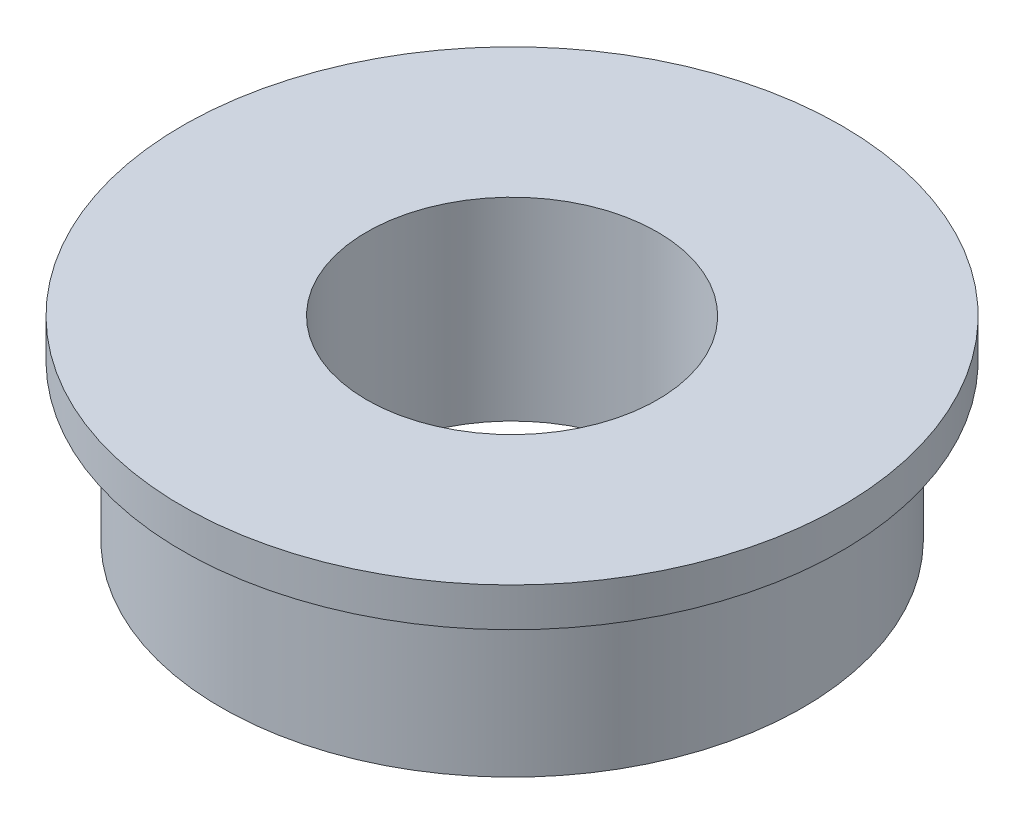
ISO-10303-21;
HEADER;
FILE_DESCRIPTION(('STEP AP214'),'2;1');
FILE_NAME('part.step','',(''),(''),'','','');
FILE_SCHEMA(('AUTOMOTIVE_DESIGN { 1 0 10303 214 1 1 1 1 }'));
ENDSEC;
DATA;
#1=APPLICATION_CONTEXT('core data for automotive mechanical design processes');
#2=APPLICATION_PROTOCOL_DEFINITION('international standard','automotive_design',2000,#1);
#3=PRODUCT_CONTEXT('',#1,'mechanical');
#4=PRODUCT('Part','Part','',(#3));
#5=PRODUCT_RELATED_PRODUCT_CATEGORY('part','',(#4));
#6=PRODUCT_DEFINITION_FORMATION('','',#4);
#7=PRODUCT_DEFINITION_CONTEXT('part definition',#1,'design');
#8=PRODUCT_DEFINITION('design','',#6,#7);
#9=PRODUCT_DEFINITION_SHAPE('','',#8);
#10=(LENGTH_UNIT() NAMED_UNIT(*) SI_UNIT(.MILLI.,.METRE.));
#11=(NAMED_UNIT(*) PLANE_ANGLE_UNIT() SI_UNIT($,.RADIAN.));
#12=(NAMED_UNIT(*) SI_UNIT($,.STERADIAN.) SOLID_ANGLE_UNIT());
#13=UNCERTAINTY_MEASURE_WITH_UNIT(LENGTH_MEASURE(1.E-05),#10,'distance_accuracy_value','');
#14=(GEOMETRIC_REPRESENTATION_CONTEXT(3) GLOBAL_UNCERTAINTY_ASSIGNED_CONTEXT((#13)) GLOBAL_UNIT_ASSIGNED_CONTEXT((#10,
#11,#12)) REPRESENTATION_CONTEXT('',''));
#15=CARTESIAN_POINT('',(0.,0.,0.));
#16=DIRECTION('',(0.,0.,1.));
#17=DIRECTION('',(1.,0.,0.));
#18=AXIS2_PLACEMENT_3D('',#15,#16,#17);
#19=CARTESIAN_POINT('',(6.,3.2,0.));
#20=DIRECTION('',(0.,-1.,0.));
#21=DIRECTION('',(0.,0.,-1.));
#22=AXIS2_PLACEMENT_3D('',#19,#20,#21);
#23=PLANE('',#22);
#24=CARTESIAN_POINT('',(0.,3.2,0.));
#25=DIRECTION('',(0.,-1.,0.));
#26=DIRECTION('',(0.,0.,-1.));
#27=AXIS2_PLACEMENT_3D('',#24,#25,#26);
#28=CIRCLE('',#27,6.8);
#29=CARTESIAN_POINT('',(0.,3.2,-6.8));
#30=VERTEX_POINT('',#29);
#31=EDGE_CURVE('E51',#30,#30,#28,.T.);
#32=ORIENTED_EDGE('',*,*,#31,.T.);
#33=EDGE_LOOP('',(#32));
#34=FACE_BOUND('',#33,.T.);
#35=CARTESIAN_POINT('',(0.,3.2,0.));
#36=DIRECTION('',(0.,-1.,0.));
#37=DIRECTION('',(0.,0.,-1.));
#38=AXIS2_PLACEMENT_3D('',#35,#36,#37);
#39=CIRCLE('',#38,6.);
#40=CARTESIAN_POINT('',(0.,3.2,-6.));
#41=VERTEX_POINT('',#40);
#42=EDGE_CURVE('E10',#41,#41,#39,.T.);
#43=ORIENTED_EDGE('',*,*,#42,.F.);
#44=EDGE_LOOP('',(#43));
#45=FACE_BOUND('',#44,.T.);
#46=ADVANCED_FACE('F29',(#34,#45),#23,.T.);
#47=CARTESIAN_POINT('',(0.,0.,0.));
#48=DIRECTION('',(0.,-1.,0.));
#49=DIRECTION('',(0.,0.,-1.));
#50=AXIS2_PLACEMENT_3D('',#47,#48,#49);
#51=CYLINDRICAL_SURFACE('',#50,6.);
#52=ORIENTED_EDGE('',*,*,#42,.T.);
#53=EDGE_LOOP('',(#52));
#54=FACE_BOUND('',#53,.T.);
#55=CARTESIAN_POINT('',(0.,0.,0.));
#56=DIRECTION('',(0.,-1.,0.));
#57=DIRECTION('',(0.,0.,-1.));
#58=AXIS2_PLACEMENT_3D('',#55,#56,#57);
#59=CIRCLE('',#58,6.);
#60=CARTESIAN_POINT('',(0.,0.,-6.));
#61=VERTEX_POINT('',#60);
#62=EDGE_CURVE('E35',#61,#61,#59,.T.);
#63=ORIENTED_EDGE('',*,*,#62,.F.);
#64=EDGE_LOOP('',(#63));
#65=FACE_BOUND('',#64,.T.);
#66=ADVANCED_FACE('F69',(#54,#65),#51,.T.);
#67=CARTESIAN_POINT('',(3.,0.,0.));
#68=DIRECTION('',(0.,-1.,0.));
#69=DIRECTION('',(0.,0.,-1.));
#70=AXIS2_PLACEMENT_3D('',#67,#68,#69);
#71=PLANE('',#70);
#72=ORIENTED_EDGE('',*,*,#62,.T.);
#73=EDGE_LOOP('',(#72));
#74=FACE_BOUND('',#73,.T.);
#75=CARTESIAN_POINT('',(0.,0.,0.));
#76=DIRECTION('',(0.,-1.,0.));
#77=DIRECTION('',(0.,0.,-1.));
#78=AXIS2_PLACEMENT_3D('',#75,#76,#77);
#79=CIRCLE('',#78,3.);
#80=CARTESIAN_POINT('',(0.,0.,-3.));
#81=VERTEX_POINT('',#80);
#82=EDGE_CURVE('E39',#81,#81,#79,.T.);
#83=ORIENTED_EDGE('',*,*,#82,.F.);
#84=EDGE_LOOP('',(#83));
#85=FACE_BOUND('',#84,.T.);
#86=ADVANCED_FACE('F73',(#74,#85),#71,.T.);
#87=CARTESIAN_POINT('',(0.,0.,0.));
#88=DIRECTION('',(0.,-1.,0.));
#89=DIRECTION('',(0.,0.,-1.));
#90=AXIS2_PLACEMENT_3D('',#87,#88,#89);
#91=CYLINDRICAL_SURFACE('',#90,3.);
#92=ORIENTED_EDGE('',*,*,#82,.T.);
#93=EDGE_LOOP('',(#92));
#94=FACE_BOUND('',#93,.T.);
#95=CARTESIAN_POINT('',(0.,4.,0.));
#96=DIRECTION('',(0.,-1.,0.));
#97=DIRECTION('',(0.,0.,-1.));
#98=AXIS2_PLACEMENT_3D('',#95,#96,#97);
#99=CIRCLE('',#98,3.);
#100=CARTESIAN_POINT('',(0.,4.,-3.));
#101=VERTEX_POINT('',#100);
#102=EDGE_CURVE('E43',#101,#101,#99,.T.);
#103=ORIENTED_EDGE('',*,*,#102,.F.);
#104=EDGE_LOOP('',(#103));
#105=FACE_BOUND('',#104,.T.);
#106=ADVANCED_FACE('F65',(#94,#105),#91,.F.);
#107=CARTESIAN_POINT('',(3.,4.,0.));
#108=DIRECTION('',(0.,1.,0.));
#109=DIRECTION('',(0.,0.,1.));
#110=AXIS2_PLACEMENT_3D('',#107,#108,#109);
#111=PLANE('',#110);
#112=ORIENTED_EDGE('',*,*,#102,.T.);
#113=EDGE_LOOP('',(#112));
#114=FACE_BOUND('',#113,.T.);
#115=CARTESIAN_POINT('',(0.,4.,0.));
#116=DIRECTION('',(0.,-1.,0.));
#117=DIRECTION('',(0.,0.,-1.));
#118=AXIS2_PLACEMENT_3D('',#115,#116,#117);
#119=CIRCLE('',#118,6.8);
#120=CARTESIAN_POINT('',(0.,4.,-6.8));
#121=VERTEX_POINT('',#120);
#122=EDGE_CURVE('E48',#121,#121,#119,.T.);
#123=ORIENTED_EDGE('',*,*,#122,.F.);
#124=EDGE_LOOP('',(#123));
#125=FACE_BOUND('',#124,.T.);
#126=ADVANCED_FACE('F59',(#114,#125),#111,.T.);
#127=CARTESIAN_POINT('',(0.,0.,0.));
#128=DIRECTION('',(0.,-1.,0.));
#129=DIRECTION('',(0.,0.,-1.));
#130=AXIS2_PLACEMENT_3D('',#127,#128,#129);
#131=CYLINDRICAL_SURFACE('',#130,6.8);
#132=ORIENTED_EDGE('',*,*,#122,.T.);
#133=EDGE_LOOP('',(#132));
#134=FACE_BOUND('',#133,.T.);
#135=ORIENTED_EDGE('',*,*,#31,.F.);
#136=EDGE_LOOP('',(#135));
#137=FACE_BOUND('',#136,.T.);
#138=ADVANCED_FACE('F57',(#134,#137),#131,.T.);
#139=CLOSED_SHELL('',(#46,#66,#86,#106,#126,#138));
#140=MANIFOLD_SOLID_BREP('B2',#139);
#141=ADVANCED_BREP_SHAPE_REPRESENTATION('',(#18,#140),#14);
#142=SHAPE_DEFINITION_REPRESENTATION(#9,#141);
ENDSEC;
END-ISO-10303-21;
